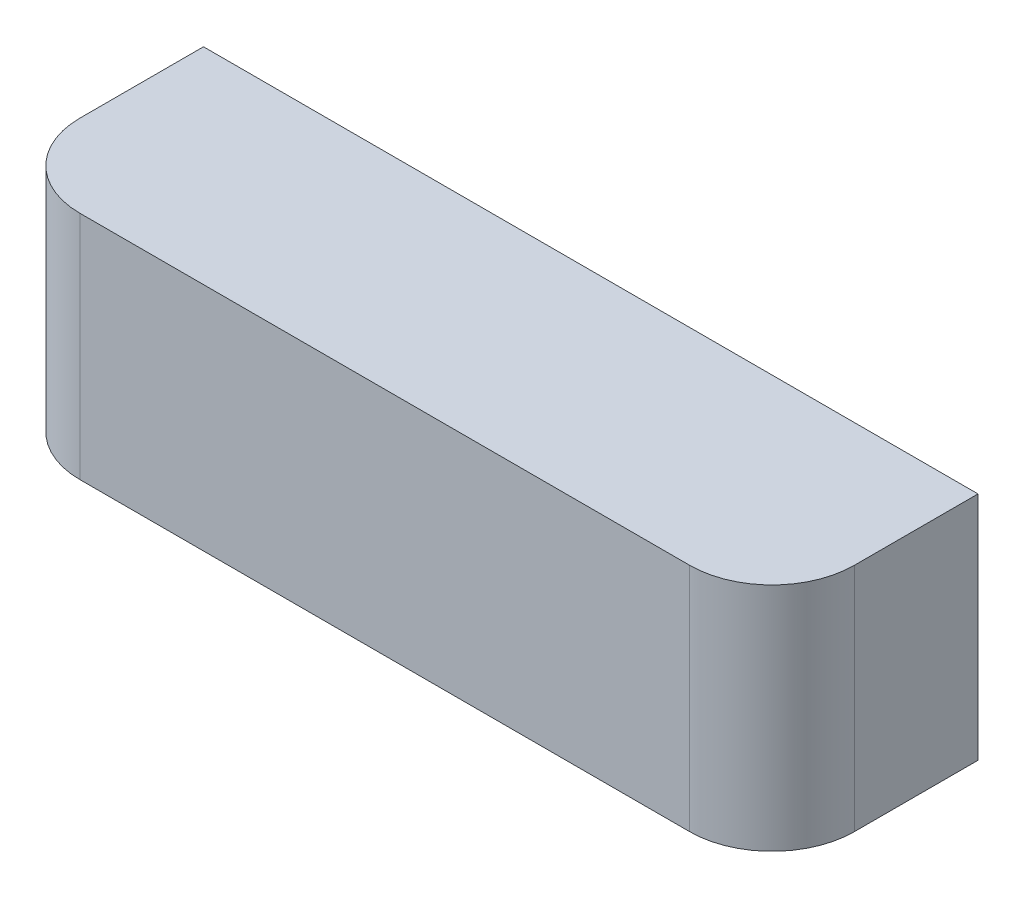
ISO-10303-21;
HEADER;
FILE_DESCRIPTION(('STEP AP214'),'2;1');
FILE_NAME('part.step','',(''),(''),'','','');
FILE_SCHEMA(('AUTOMOTIVE_DESIGN { 1 0 10303 214 1 1 1 1 }'));
ENDSEC;
DATA;
#1=APPLICATION_CONTEXT('core data for automotive mechanical design processes');
#2=APPLICATION_PROTOCOL_DEFINITION('international standard','automotive_design',2000,#1);
#3=PRODUCT_CONTEXT('',#1,'mechanical');
#4=PRODUCT('Part','Part','',(#3));
#5=PRODUCT_RELATED_PRODUCT_CATEGORY('part','',(#4));
#6=PRODUCT_DEFINITION_FORMATION('','',#4);
#7=PRODUCT_DEFINITION_CONTEXT('part definition',#1,'design');
#8=PRODUCT_DEFINITION('design','',#6,#7);
#9=PRODUCT_DEFINITION_SHAPE('','',#8);
#10=(LENGTH_UNIT() NAMED_UNIT(*) SI_UNIT(.MILLI.,.METRE.));
#11=(NAMED_UNIT(*) PLANE_ANGLE_UNIT() SI_UNIT($,.RADIAN.));
#12=(NAMED_UNIT(*) SI_UNIT($,.STERADIAN.) SOLID_ANGLE_UNIT());
#13=UNCERTAINTY_MEASURE_WITH_UNIT(LENGTH_MEASURE(1.E-05),#10,'distance_accuracy_value','');
#14=(GEOMETRIC_REPRESENTATION_CONTEXT(3) GLOBAL_UNCERTAINTY_ASSIGNED_CONTEXT((#13)) GLOBAL_UNIT_ASSIGNED_CONTEXT((#10,
#11,#12)) REPRESENTATION_CONTEXT('',''));
#15=CARTESIAN_POINT('',(0.,0.,0.));
#16=DIRECTION('',(0.,0.,1.));
#17=DIRECTION('',(1.,0.,0.));
#18=AXIS2_PLACEMENT_3D('',#15,#16,#17);
#19=CARTESIAN_POINT('',(0.,0.,0.));
#20=DIRECTION('',(0.,0.,1.));
#21=DIRECTION('',(1.,0.,0.));
#22=AXIS2_PLACEMENT_3D('',#19,#20,#21);
#23=PLANE('',#22);
#24=DIRECTION('',(0.,1.,0.));
#25=VECTOR('',#24,1.);
#26=CARTESIAN_POINT('',(47.,14.,0.));
#27=LINE('',#26,#25);
#28=CARTESIAN_POINT('',(47.,-14.,0.));
#29=VERTEX_POINT('',#28);
#30=CARTESIAN_POINT('',(47.,14.,0.));
#31=VERTEX_POINT('',#30);
#32=EDGE_CURVE('E138',#29,#31,#27,.T.);
#33=ORIENTED_EDGE('',*,*,#32,.F.);
#34=DIRECTION('',(1.,0.,0.));
#35=VECTOR('',#34,1.);
#36=CARTESIAN_POINT('',(-47.,-14.,0.));
#37=LINE('',#36,#35);
#38=CARTESIAN_POINT('',(-47.,-14.,0.));
#39=VERTEX_POINT('',#38);
#40=EDGE_CURVE('E151',#39,#29,#37,.T.);
#41=ORIENTED_EDGE('',*,*,#40,.F.);
#42=DIRECTION('',(0.,-1.,0.));
#43=VECTOR('',#42,1.);
#44=CARTESIAN_POINT('',(-47.,14.,0.));
#45=LINE('',#44,#43);
#46=CARTESIAN_POINT('',(-47.,14.,0.));
#47=VERTEX_POINT('',#46);
#48=EDGE_CURVE('E157',#47,#39,#45,.T.);
#49=ORIENTED_EDGE('',*,*,#48,.F.);
#50=DIRECTION('',(-1.,0.,0.));
#51=VECTOR('',#50,1.);
#52=CARTESIAN_POINT('',(-47.,14.,0.));
#53=LINE('',#52,#51);
#54=EDGE_CURVE('E141',#31,#47,#53,.T.);
#55=ORIENTED_EDGE('',*,*,#54,.F.);
#56=EDGE_LOOP('',(#33,#41,#49,#55));
#57=FACE_BOUND('',#56,.T.);
#58=DIRECTION('',(0.,1.,0.));
#59=VECTOR('',#58,1.);
#60=CARTESIAN_POINT('',(7.,1.,0.));
#61=LINE('',#60,#59);
#62=CARTESIAN_POINT('',(7.,-8.5,0.));
#63=VERTEX_POINT('',#62);
#64=CARTESIAN_POINT('',(7.,1.,0.));
#65=VERTEX_POINT('',#64);
#66=EDGE_CURVE('E137',#63,#65,#61,.T.);
#67=ORIENTED_EDGE('',*,*,#66,.F.);
#68=DIRECTION('',(-1.,0.,0.));
#69=VECTOR('',#68,1.);
#70=CARTESIAN_POINT('',(20.,-8.50000000000001,0.));
#71=LINE('',#70,#69);
#72=CARTESIAN_POINT('',(20.,-8.50000000000001,0.));
#73=VERTEX_POINT('',#72);
#74=EDGE_CURVE('E134',#73,#63,#71,.T.);
#75=ORIENTED_EDGE('',*,*,#74,.F.);
#76=DIRECTION('',(0.,-1.,0.));
#77=VECTOR('',#76,1.);
#78=CARTESIAN_POINT('',(20.,1.,0.));
#79=LINE('',#78,#77);
#80=CARTESIAN_POINT('',(20.,1.,0.));
#81=VERTEX_POINT('',#80);
#82=EDGE_CURVE('E61',#81,#73,#79,.T.);
#83=ORIENTED_EDGE('',*,*,#82,.F.);
#84=DIRECTION('',(1.,0.,0.));
#85=VECTOR('',#84,1.);
#86=CARTESIAN_POINT('',(20.,1.,0.));
#87=LINE('',#86,#85);
#88=EDGE_CURVE('E56',#65,#81,#87,.T.);
#89=ORIENTED_EDGE('',*,*,#88,.F.);
#90=EDGE_LOOP('',(#67,#75,#83,#89));
#91=FACE_BOUND('',#90,.T.);
#92=ADVANCED_FACE('F41',(#57,#91),#23,.F.);
#93=CARTESIAN_POINT('',(47.,14.,25.));
#94=DIRECTION('',(-1.,0.,0.));
#95=DIRECTION('',(0.,-1.,0.));
#96=AXIS2_PLACEMENT_3D('',#93,#94,#95);
#97=PLANE('',#96);
#98=DIRECTION('',(0.,0.,-1.));
#99=VECTOR('',#98,1.);
#100=CARTESIAN_POINT('',(47.,14.,25.));
#101=LINE('',#100,#99);
#102=CARTESIAN_POINT('',(47.,14.,15.));
#103=VERTEX_POINT('',#102);
#104=EDGE_CURVE('E167',#103,#31,#101,.T.);
#105=ORIENTED_EDGE('',*,*,#104,.F.);
#106=DIRECTION('',(0.,1.,0.));
#107=VECTOR('',#106,1.);
#108=CARTESIAN_POINT('',(47.,-14.,15.));
#109=LINE('',#108,#107);
#110=CARTESIAN_POINT('',(47.,-14.,15.));
#111=VERTEX_POINT('',#110);
#112=EDGE_CURVE('E11',#103,#111,#109,.F.);
#113=ORIENTED_EDGE('',*,*,#112,.T.);
#114=DIRECTION('',(0.,0.,-1.));
#115=VECTOR('',#114,1.);
#116=CARTESIAN_POINT('',(47.,-14.,25.));
#117=LINE('',#116,#115);
#118=EDGE_CURVE('E153',#111,#29,#117,.T.);
#119=ORIENTED_EDGE('',*,*,#118,.T.);
#120=ORIENTED_EDGE('',*,*,#32,.T.);
#121=EDGE_LOOP('',(#105,#113,#119,#120));
#122=FACE_BOUND('',#121,.T.);
#123=ADVANCED_FACE('F211',(#122),#97,.F.);
#124=CARTESIAN_POINT('',(-47.,14.,25.));
#125=DIRECTION('',(0.,-1.,0.));
#126=DIRECTION('',(0.,0.,-1.));
#127=AXIS2_PLACEMENT_3D('',#124,#125,#126);
#128=PLANE('',#127);
#129=DIRECTION('',(0.,0.,-1.));
#130=VECTOR('',#129,1.);
#131=CARTESIAN_POINT('',(-47.,14.,25.));
#132=LINE('',#131,#130);
#133=CARTESIAN_POINT('',(-47.,14.,15.));
#134=VERTEX_POINT('',#133);
#135=EDGE_CURVE('E165',#134,#47,#132,.T.);
#136=ORIENTED_EDGE('',*,*,#135,.F.);
#137=CARTESIAN_POINT('',(-37.,14.,15.));
#138=DIRECTION('',(0.,-1.,0.));
#139=DIRECTION('',(0.,0.,-1.));
#140=AXIS2_PLACEMENT_3D('',#137,#138,#139);
#141=CIRCLE('',#140,10.);
#142=CARTESIAN_POINT('',(-37.,14.,25.));
#143=VERTEX_POINT('',#142);
#144=EDGE_CURVE('E49',#134,#143,#141,.F.);
#145=ORIENTED_EDGE('',*,*,#144,.T.);
#146=DIRECTION('',(-1.,0.,0.));
#147=VECTOR('',#146,1.);
#148=CARTESIAN_POINT('',(-47.,14.,25.));
#149=LINE('',#148,#147);
#150=CARTESIAN_POINT('',(37.,14.,25.));
#151=VERTEX_POINT('',#150);
#152=EDGE_CURVE('E147',#151,#143,#149,.T.);
#153=ORIENTED_EDGE('',*,*,#152,.F.);
#154=CARTESIAN_POINT('',(37.,14.,15.));
#155=DIRECTION('',(0.,-1.,0.));
#156=DIRECTION('',(0.,0.,-1.));
#157=AXIS2_PLACEMENT_3D('',#154,#155,#156);
#158=CIRCLE('',#157,10.);
#159=EDGE_CURVE('E181',#151,#103,#158,.F.);
#160=ORIENTED_EDGE('',*,*,#159,.T.);
#161=ORIENTED_EDGE('',*,*,#104,.T.);
#162=ORIENTED_EDGE('',*,*,#54,.T.);
#163=EDGE_LOOP('',(#136,#145,#153,#160,#161,#162));
#164=FACE_BOUND('',#163,.T.);
#165=ADVANCED_FACE('F186',(#164),#128,.F.);
#166=CARTESIAN_POINT('',(-47.,14.,25.));
#167=DIRECTION('',(1.,0.,0.));
#168=DIRECTION('',(0.,0.,-1.));
#169=AXIS2_PLACEMENT_3D('',#166,#167,#168);
#170=PLANE('',#169);
#171=DIRECTION('',(0.,0.,-1.));
#172=VECTOR('',#171,1.);
#173=CARTESIAN_POINT('',(-47.,-14.,25.));
#174=LINE('',#173,#172);
#175=CARTESIAN_POINT('',(-47.,-14.,15.));
#176=VERTEX_POINT('',#175);
#177=EDGE_CURVE('E163',#176,#39,#174,.T.);
#178=ORIENTED_EDGE('',*,*,#177,.F.);
#179=DIRECTION('',(0.,-1.,0.));
#180=VECTOR('',#179,1.);
#181=CARTESIAN_POINT('',(-47.,14.,15.));
#182=LINE('',#181,#180);
#183=EDGE_CURVE('E179',#176,#134,#182,.F.);
#184=ORIENTED_EDGE('',*,*,#183,.T.);
#185=ORIENTED_EDGE('',*,*,#135,.T.);
#186=ORIENTED_EDGE('',*,*,#48,.T.);
#187=EDGE_LOOP('',(#178,#184,#185,#186));
#188=FACE_BOUND('',#187,.T.);
#189=ADVANCED_FACE('F199',(#188),#170,.F.);
#190=CARTESIAN_POINT('',(-47.,-14.,25.));
#191=DIRECTION('',(0.,1.,0.));
#192=DIRECTION('',(0.,0.,1.));
#193=AXIS2_PLACEMENT_3D('',#190,#191,#192);
#194=PLANE('',#193);
#195=DIRECTION('',(1.,0.,0.));
#196=VECTOR('',#195,1.);
#197=CARTESIAN_POINT('',(-47.,-14.,25.));
#198=LINE('',#197,#196);
#199=CARTESIAN_POINT('',(-37.,-14.,25.));
#200=VERTEX_POINT('',#199);
#201=CARTESIAN_POINT('',(37.,-14.,25.));
#202=VERTEX_POINT('',#201);
#203=EDGE_CURVE('E150',#200,#202,#198,.T.);
#204=ORIENTED_EDGE('',*,*,#203,.F.);
#205=CARTESIAN_POINT('',(-37.,-14.,15.));
#206=DIRECTION('',(0.,1.,0.));
#207=DIRECTION('',(0.,0.,1.));
#208=AXIS2_PLACEMENT_3D('',#205,#206,#207);
#209=CIRCLE('',#208,10.);
#210=EDGE_CURVE('E177',#200,#176,#209,.F.);
#211=ORIENTED_EDGE('',*,*,#210,.T.);
#212=ORIENTED_EDGE('',*,*,#177,.T.);
#213=ORIENTED_EDGE('',*,*,#40,.T.);
#214=ORIENTED_EDGE('',*,*,#118,.F.);
#215=CARTESIAN_POINT('',(37.,-14.,15.));
#216=DIRECTION('',(0.,1.,0.));
#217=DIRECTION('',(0.,0.,1.));
#218=AXIS2_PLACEMENT_3D('',#215,#216,#217);
#219=CIRCLE('',#218,10.);
#220=EDGE_CURVE('E175',#111,#202,#219,.F.);
#221=ORIENTED_EDGE('',*,*,#220,.T.);
#222=EDGE_LOOP('',(#204,#211,#212,#213,#214,#221));
#223=FACE_BOUND('',#222,.T.);
#224=ADVANCED_FACE('F197',(#223),#194,.F.);
#225=CARTESIAN_POINT('',(0.,0.,25.));
#226=DIRECTION('',(0.,0.,1.));
#227=DIRECTION('',(1.,0.,0.));
#228=AXIS2_PLACEMENT_3D('',#225,#226,#227);
#229=PLANE('',#228);
#230=ORIENTED_EDGE('',*,*,#152,.T.);
#231=DIRECTION('',(0.,-1.,0.));
#232=VECTOR('',#231,1.);
#233=CARTESIAN_POINT('',(-37.,-14.,25.));
#234=LINE('',#233,#232);
#235=EDGE_CURVE('E172',#143,#200,#234,.T.);
#236=ORIENTED_EDGE('',*,*,#235,.T.);
#237=ORIENTED_EDGE('',*,*,#203,.T.);
#238=DIRECTION('',(0.,1.,0.));
#239=VECTOR('',#238,1.);
#240=CARTESIAN_POINT('',(37.,14.,25.));
#241=LINE('',#240,#239);
#242=EDGE_CURVE('E169',#202,#151,#241,.T.);
#243=ORIENTED_EDGE('',*,*,#242,.T.);
#244=EDGE_LOOP('',(#230,#236,#237,#243));
#245=FACE_BOUND('',#244,.T.);
#246=ADVANCED_FACE('F191',(#245),#229,.T.);
#247=CARTESIAN_POINT('',(-37.,0.,15.));
#248=DIRECTION('',(0.,1.,0.));
#249=DIRECTION('',(0.,0.,1.));
#250=AXIS2_PLACEMENT_3D('',#247,#248,#249);
#251=CYLINDRICAL_SURFACE('',#250,10.);
#252=ORIENTED_EDGE('',*,*,#144,.F.);
#253=ORIENTED_EDGE('',*,*,#183,.F.);
#254=ORIENTED_EDGE('',*,*,#210,.F.);
#255=ORIENTED_EDGE('',*,*,#235,.F.);
#256=EDGE_LOOP('',(#252,#253,#254,#255));
#257=FACE_BOUND('',#256,.T.);
#258=ADVANCED_FACE('F194',(#257),#251,.T.);
#259=CARTESIAN_POINT('',(37.,0.,15.));
#260=DIRECTION('',(0.,-1.,0.));
#261=DIRECTION('',(1.,0.,0.));
#262=AXIS2_PLACEMENT_3D('',#259,#260,#261);
#263=CYLINDRICAL_SURFACE('',#262,10.);
#264=ORIENTED_EDGE('',*,*,#220,.F.);
#265=ORIENTED_EDGE('',*,*,#112,.F.);
#266=ORIENTED_EDGE('',*,*,#159,.F.);
#267=ORIENTED_EDGE('',*,*,#242,.F.);
#268=EDGE_LOOP('',(#264,#265,#266,#267));
#269=FACE_BOUND('',#268,.T.);
#270=ADVANCED_FACE('F43',(#269),#263,.T.);
#271=CARTESIAN_POINT('',(7.,1.,-10.));
#272=DIRECTION('',(1.,0.,0.));
#273=DIRECTION('',(0.,1.,0.));
#274=AXIS2_PLACEMENT_3D('',#271,#272,#273);
#275=PLANE('',#274);
#276=ORIENTED_EDGE('',*,*,#66,.T.);
#277=DIRECTION('',(0.,0.,1.));
#278=VECTOR('',#277,1.);
#279=CARTESIAN_POINT('',(7.,1.,-10.));
#280=LINE('',#279,#278);
#281=CARTESIAN_POINT('',(7.,1.,-10.));
#282=VERTEX_POINT('',#281);
#283=EDGE_CURVE('E118',#282,#65,#280,.T.);
#284=ORIENTED_EDGE('',*,*,#283,.F.);
#285=DIRECTION('',(0.,1.,0.));
#286=VECTOR('',#285,1.);
#287=CARTESIAN_POINT('',(7.,1.,-10.));
#288=LINE('',#287,#286);
#289=CARTESIAN_POINT('',(7.,-8.5,-10.));
#290=VERTEX_POINT('',#289);
#291=EDGE_CURVE('E125',#290,#282,#288,.T.);
#292=ORIENTED_EDGE('',*,*,#291,.F.);
#293=DIRECTION('',(0.,0.,1.));
#294=VECTOR('',#293,1.);
#295=CARTESIAN_POINT('',(7.,-8.5,-10.));
#296=LINE('',#295,#294);
#297=EDGE_CURVE('E291',#290,#63,#296,.T.);
#298=ORIENTED_EDGE('',*,*,#297,.T.);
#299=EDGE_LOOP('',(#276,#284,#292,#298));
#300=FACE_BOUND('',#299,.T.);
#301=ADVANCED_FACE('F136',(#300),#275,.F.);
#302=CARTESIAN_POINT('',(20.,1.,-10.));
#303=DIRECTION('',(0.,-1.,0.));
#304=DIRECTION('',(1.,0.,0.));
#305=AXIS2_PLACEMENT_3D('',#302,#303,#304);
#306=PLANE('',#305);
#307=ORIENTED_EDGE('',*,*,#88,.T.);
#308=DIRECTION('',(0.,0.,1.));
#309=VECTOR('',#308,1.);
#310=CARTESIAN_POINT('',(20.,1.,-10.));
#311=LINE('',#310,#309);
#312=CARTESIAN_POINT('',(20.,1.,-10.));
#313=VERTEX_POINT('',#312);
#314=EDGE_CURVE('E121',#313,#81,#311,.T.);
#315=ORIENTED_EDGE('',*,*,#314,.F.);
#316=DIRECTION('',(1.,0.,0.));
#317=VECTOR('',#316,1.);
#318=CARTESIAN_POINT('',(20.,1.,-10.));
#319=LINE('',#318,#317);
#320=EDGE_CURVE('E114',#282,#313,#319,.T.);
#321=ORIENTED_EDGE('',*,*,#320,.F.);
#322=ORIENTED_EDGE('',*,*,#283,.T.);
#323=EDGE_LOOP('',(#307,#315,#321,#322));
#324=FACE_BOUND('',#323,.T.);
#325=ADVANCED_FACE('F116',(#324),#306,.F.);
#326=CARTESIAN_POINT('',(20.,1.,-10.));
#327=DIRECTION('',(-1.,0.,0.));
#328=DIRECTION('',(0.,-1.,0.));
#329=AXIS2_PLACEMENT_3D('',#326,#327,#328);
#330=PLANE('',#329);
#331=ORIENTED_EDGE('',*,*,#82,.T.);
#332=DIRECTION('',(0.,0.,1.));
#333=VECTOR('',#332,1.);
#334=CARTESIAN_POINT('',(20.,-8.50000000000001,-10.));
#335=LINE('',#334,#333);
#336=CARTESIAN_POINT('',(20.,-8.50000000000001,-10.));
#337=VERTEX_POINT('',#336);
#338=EDGE_CURVE('E143',#337,#73,#335,.T.);
#339=ORIENTED_EDGE('',*,*,#338,.F.);
#340=DIRECTION('',(0.,-1.,0.));
#341=VECTOR('',#340,1.);
#342=CARTESIAN_POINT('',(20.,1.,-10.));
#343=LINE('',#342,#341);
#344=EDGE_CURVE('E124',#313,#337,#343,.T.);
#345=ORIENTED_EDGE('',*,*,#344,.F.);
#346=ORIENTED_EDGE('',*,*,#314,.T.);
#347=EDGE_LOOP('',(#331,#339,#345,#346));
#348=FACE_BOUND('',#347,.T.);
#349=ADVANCED_FACE('F267',(#348),#330,.F.);
#350=CARTESIAN_POINT('',(20.,-8.50000000000001,-10.));
#351=DIRECTION('',(0.,1.,0.));
#352=DIRECTION('',(-1.,0.,0.));
#353=AXIS2_PLACEMENT_3D('',#350,#351,#352);
#354=PLANE('',#353);
#355=ORIENTED_EDGE('',*,*,#74,.T.);
#356=ORIENTED_EDGE('',*,*,#297,.F.);
#357=DIRECTION('',(-1.,0.,0.));
#358=VECTOR('',#357,1.);
#359=CARTESIAN_POINT('',(20.,-8.50000000000001,-10.));
#360=LINE('',#359,#358);
#361=EDGE_CURVE('E130',#337,#290,#360,.T.);
#362=ORIENTED_EDGE('',*,*,#361,.F.);
#363=ORIENTED_EDGE('',*,*,#338,.T.);
#364=EDGE_LOOP('',(#355,#356,#362,#363));
#365=FACE_BOUND('',#364,.T.);
#366=ADVANCED_FACE('F273',(#365),#354,.F.);
#367=CARTESIAN_POINT('',(0.,0.,-10.));
#368=DIRECTION('',(0.,0.,-1.));
#369=DIRECTION('',(-1.,0.,0.));
#370=AXIS2_PLACEMENT_3D('',#367,#368,#369);
#371=PLANE('',#370);
#372=ORIENTED_EDGE('',*,*,#291,.T.);
#373=ORIENTED_EDGE('',*,*,#320,.T.);
#374=ORIENTED_EDGE('',*,*,#344,.T.);
#375=ORIENTED_EDGE('',*,*,#361,.T.);
#376=EDGE_LOOP('',(#372,#373,#374,#375));
#377=FACE_BOUND('',#376,.T.);
#378=ADVANCED_FACE('F128',(#377),#371,.T.);
#379=CLOSED_SHELL('',(#92,#123,#165,#189,#224,#246,#258,#270,#301,#325,#349,#366,#378));
#380=MANIFOLD_SOLID_BREP('B2',#379);
#381=ADVANCED_BREP_SHAPE_REPRESENTATION('',(#18,#380),#14);
#382=SHAPE_DEFINITION_REPRESENTATION(#9,#381);
ENDSEC;
END-ISO-10303-21;
